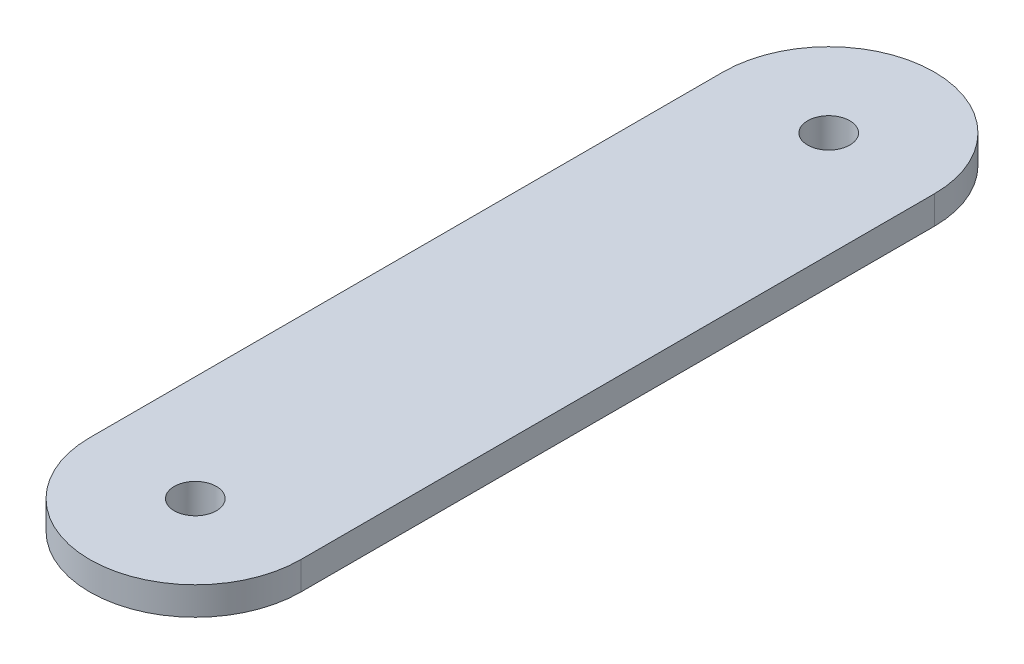
ISO-10303-21;
HEADER;
FILE_DESCRIPTION(('STEP AP214'),'2;1');
FILE_NAME('part.step','',(''),(''),'','','');
FILE_SCHEMA(('AUTOMOTIVE_DESIGN { 1 0 10303 214 1 1 1 1 }'));
ENDSEC;
DATA;
#1=APPLICATION_CONTEXT('core data for automotive mechanical design processes');
#2=APPLICATION_PROTOCOL_DEFINITION('international standard','automotive_design',2000,#1);
#3=PRODUCT_CONTEXT('',#1,'mechanical');
#4=PRODUCT('Part','Part','',(#3));
#5=PRODUCT_RELATED_PRODUCT_CATEGORY('part','',(#4));
#6=PRODUCT_DEFINITION_FORMATION('','',#4);
#7=PRODUCT_DEFINITION_CONTEXT('part definition',#1,'design');
#8=PRODUCT_DEFINITION('design','',#6,#7);
#9=PRODUCT_DEFINITION_SHAPE('','',#8);
#10=(LENGTH_UNIT() NAMED_UNIT(*) SI_UNIT(.MILLI.,.METRE.));
#11=(NAMED_UNIT(*) PLANE_ANGLE_UNIT() SI_UNIT($,.RADIAN.));
#12=(NAMED_UNIT(*) SI_UNIT($,.STERADIAN.) SOLID_ANGLE_UNIT());
#13=UNCERTAINTY_MEASURE_WITH_UNIT(LENGTH_MEASURE(1.E-05),#10,'distance_accuracy_value','');
#14=(GEOMETRIC_REPRESENTATION_CONTEXT(3) GLOBAL_UNCERTAINTY_ASSIGNED_CONTEXT((#13)) GLOBAL_UNIT_ASSIGNED_CONTEXT((#10,
#11,#12)) REPRESENTATION_CONTEXT('',''));
#15=CARTESIAN_POINT('',(0.,0.,0.));
#16=DIRECTION('',(0.,0.,1.));
#17=DIRECTION('',(1.,0.,0.));
#18=AXIS2_PLACEMENT_3D('',#15,#16,#17);
#19=CARTESIAN_POINT('',(0.,0.,-22.5));
#20=DIRECTION('',(0.,1.,0.));
#21=DIRECTION('',(0.,0.,1.));
#22=AXIS2_PLACEMENT_3D('',#19,#20,#21);
#23=PLANE('',#22);
#24=CARTESIAN_POINT('',(0.,0.,-22.5));
#25=DIRECTION('',(0.,1.,0.));
#26=DIRECTION('',(0.,0.,1.));
#27=AXIS2_PLACEMENT_3D('',#24,#25,#26);
#28=CIRCLE('',#27,4.42944947177033);
#29=CARTESIAN_POINT('',(0.,0.,-18.0705505282297));
#30=VERTEX_POINT('',#29);
#31=EDGE_CURVE('E11',#30,#30,#28,.T.);
#32=ORIENTED_EDGE('',*,*,#31,.T.);
#33=EDGE_LOOP('',(#32));
#34=FACE_BOUND('',#33,.T.);
#35=CARTESIAN_POINT('',(0.,0.,22.5));
#36=DIRECTION('',(0.,1.,0.));
#37=DIRECTION('',(0.,0.,1.));
#38=AXIS2_PLACEMENT_3D('',#35,#36,#37);
#39=CIRCLE('',#38,4.42944947177033);
#40=CARTESIAN_POINT('',(0.,0.,26.9294494717703));
#41=VERTEX_POINT('',#40);
#42=EDGE_CURVE('E46',#41,#41,#39,.T.);
#43=ORIENTED_EDGE('',*,*,#42,.T.);
#44=EDGE_LOOP('',(#43));
#45=FACE_BOUND('',#44,.T.);
#46=CARTESIAN_POINT('',(0.,0.,-22.5));
#47=DIRECTION('',(0.,1.,0.));
#48=DIRECTION('',(0.,0.,1.));
#49=AXIS2_PLACEMENT_3D('',#46,#47,#48);
#50=CIRCLE('',#49,7.5);
#51=CARTESIAN_POINT('',(7.49999999999999,0.,-22.5));
#52=VERTEX_POINT('',#51);
#53=CARTESIAN_POINT('',(-7.50000000000001,0.,-22.5));
#54=VERTEX_POINT('',#53);
#55=EDGE_CURVE('E105',#52,#54,#50,.T.);
#56=ORIENTED_EDGE('',*,*,#55,.F.);
#57=DIRECTION('',(0.,0.,-1.));
#58=VECTOR('',#57,1.);
#59=CARTESIAN_POINT('',(7.49999999999999,0.,-22.5));
#60=LINE('',#59,#58);
#61=CARTESIAN_POINT('',(7.5,0.,22.5));
#62=VERTEX_POINT('',#61);
#63=EDGE_CURVE('E77',#62,#52,#60,.T.);
#64=ORIENTED_EDGE('',*,*,#63,.F.);
#65=CARTESIAN_POINT('',(0.,0.,22.5));
#66=DIRECTION('',(0.,1.,0.));
#67=DIRECTION('',(0.,0.,1.));
#68=AXIS2_PLACEMENT_3D('',#65,#66,#67);
#69=CIRCLE('',#68,7.5);
#70=CARTESIAN_POINT('',(-7.5,0.,22.5));
#71=VERTEX_POINT('',#70);
#72=EDGE_CURVE('E71',#71,#62,#69,.T.);
#73=ORIENTED_EDGE('',*,*,#72,.F.);
#74=DIRECTION('',(0.,0.,1.));
#75=VECTOR('',#74,1.);
#76=CARTESIAN_POINT('',(-7.50000000000001,0.,-22.5));
#77=LINE('',#76,#75);
#78=EDGE_CURVE('E95',#54,#71,#77,.T.);
#79=ORIENTED_EDGE('',*,*,#78,.F.);
#80=EDGE_LOOP('',(#56,#64,#73,#79));
#81=FACE_BOUND('',#80,.T.);
#82=ADVANCED_FACE('F37',(#34,#45,#81),#23,.F.);
#83=CARTESIAN_POINT('',(0.,2.,-22.5));
#84=DIRECTION('',(0.,-1.,0.));
#85=DIRECTION('',(0.,0.,-1.));
#86=AXIS2_PLACEMENT_3D('',#83,#84,#85);
#87=CYLINDRICAL_SURFACE('',#86,7.5);
#88=ORIENTED_EDGE('',*,*,#55,.T.);
#89=DIRECTION('',(0.,-1.,0.));
#90=VECTOR('',#89,1.);
#91=CARTESIAN_POINT('',(-7.50000000000001,2.,-22.5));
#92=LINE('',#91,#90);
#93=CARTESIAN_POINT('',(-7.50000000000001,2.,-22.5));
#94=VERTEX_POINT('',#93);
#95=EDGE_CURVE('E96',#94,#54,#92,.T.);
#96=ORIENTED_EDGE('',*,*,#95,.F.);
#97=CARTESIAN_POINT('',(0.,2.,-22.5));
#98=DIRECTION('',(0.,1.,0.));
#99=DIRECTION('',(0.,0.,1.));
#100=AXIS2_PLACEMENT_3D('',#97,#98,#99);
#101=CIRCLE('',#100,7.5);
#102=CARTESIAN_POINT('',(7.49999999999999,2.,-22.5));
#103=VERTEX_POINT('',#102);
#104=EDGE_CURVE('E90',#103,#94,#101,.T.);
#105=ORIENTED_EDGE('',*,*,#104,.F.);
#106=DIRECTION('',(0.,-1.,0.));
#107=VECTOR('',#106,1.);
#108=CARTESIAN_POINT('',(7.49999999999999,2.,-22.5));
#109=LINE('',#108,#107);
#110=EDGE_CURVE('E101',#103,#52,#109,.T.);
#111=ORIENTED_EDGE('',*,*,#110,.T.);
#112=EDGE_LOOP('',(#88,#96,#105,#111));
#113=FACE_BOUND('',#112,.T.);
#114=ADVANCED_FACE('F166',(#113),#87,.T.);
#115=CARTESIAN_POINT('',(-7.50000000000001,2.,-22.5));
#116=DIRECTION('',(1.,0.,0.));
#117=DIRECTION('',(0.,0.,-1.));
#118=AXIS2_PLACEMENT_3D('',#115,#116,#117);
#119=PLANE('',#118);
#120=ORIENTED_EDGE('',*,*,#78,.T.);
#121=DIRECTION('',(0.,-1.,0.));
#122=VECTOR('',#121,1.);
#123=CARTESIAN_POINT('',(-7.5,2.,22.5));
#124=LINE('',#123,#122);
#125=CARTESIAN_POINT('',(-7.5,2.,22.5));
#126=VERTEX_POINT('',#125);
#127=EDGE_CURVE('E93',#126,#71,#124,.T.);
#128=ORIENTED_EDGE('',*,*,#127,.F.);
#129=DIRECTION('',(0.,0.,1.));
#130=VECTOR('',#129,1.);
#131=CARTESIAN_POINT('',(-7.50000000000001,2.,-22.5));
#132=LINE('',#131,#130);
#133=EDGE_CURVE('E85',#94,#126,#132,.T.);
#134=ORIENTED_EDGE('',*,*,#133,.F.);
#135=ORIENTED_EDGE('',*,*,#95,.T.);
#136=EDGE_LOOP('',(#120,#128,#134,#135));
#137=FACE_BOUND('',#136,.T.);
#138=ADVANCED_FACE('F94',(#137),#119,.F.);
#139=CARTESIAN_POINT('',(0.,2.,22.5));
#140=DIRECTION('',(0.,-1.,0.));
#141=DIRECTION('',(0.,0.,-1.));
#142=AXIS2_PLACEMENT_3D('',#139,#140,#141);
#143=CYLINDRICAL_SURFACE('',#142,7.5);
#144=ORIENTED_EDGE('',*,*,#72,.T.);
#145=DIRECTION('',(0.,-1.,0.));
#146=VECTOR('',#145,1.);
#147=CARTESIAN_POINT('',(7.5,2.,22.5));
#148=LINE('',#147,#146);
#149=CARTESIAN_POINT('',(7.5,2.,22.5));
#150=VERTEX_POINT('',#149);
#151=EDGE_CURVE('E97',#150,#62,#148,.T.);
#152=ORIENTED_EDGE('',*,*,#151,.F.);
#153=CARTESIAN_POINT('',(0.,2.,22.5));
#154=DIRECTION('',(0.,1.,0.));
#155=DIRECTION('',(0.,0.,1.));
#156=AXIS2_PLACEMENT_3D('',#153,#154,#155);
#157=CIRCLE('',#156,7.5);
#158=EDGE_CURVE('E88',#126,#150,#157,.T.);
#159=ORIENTED_EDGE('',*,*,#158,.F.);
#160=ORIENTED_EDGE('',*,*,#127,.T.);
#161=EDGE_LOOP('',(#144,#152,#159,#160));
#162=FACE_BOUND('',#161,.T.);
#163=ADVANCED_FACE('F99',(#162),#143,.T.);
#164=CARTESIAN_POINT('',(7.49999999999999,2.,-22.5));
#165=DIRECTION('',(-1.,0.,0.));
#166=DIRECTION('',(0.,0.,1.));
#167=AXIS2_PLACEMENT_3D('',#164,#165,#166);
#168=PLANE('',#167);
#169=ORIENTED_EDGE('',*,*,#63,.T.);
#170=ORIENTED_EDGE('',*,*,#110,.F.);
#171=DIRECTION('',(0.,0.,-1.));
#172=VECTOR('',#171,1.);
#173=CARTESIAN_POINT('',(7.49999999999999,2.,-22.5));
#174=LINE('',#173,#172);
#175=EDGE_CURVE('E54',#150,#103,#174,.T.);
#176=ORIENTED_EDGE('',*,*,#175,.F.);
#177=ORIENTED_EDGE('',*,*,#151,.T.);
#178=EDGE_LOOP('',(#169,#170,#176,#177));
#179=FACE_BOUND('',#178,.T.);
#180=ADVANCED_FACE('F145',(#179),#168,.F.);
#181=CARTESIAN_POINT('',(0.,2.,-22.5));
#182=DIRECTION('',(0.,1.,0.));
#183=DIRECTION('',(0.,0.,1.));
#184=AXIS2_PLACEMENT_3D('',#181,#182,#183);
#185=PLANE('',#184);
#186=CARTESIAN_POINT('',(0.,2.,-22.5));
#187=DIRECTION('',(0.,1.,0.));
#188=DIRECTION('',(0.,0.,1.));
#189=AXIS2_PLACEMENT_3D('',#186,#187,#188);
#190=CIRCLE('',#189,1.5);
#191=CARTESIAN_POINT('',(0.,2.,-21.));
#192=VERTEX_POINT('',#191);
#193=EDGE_CURVE('E108',#192,#192,#190,.T.);
#194=ORIENTED_EDGE('',*,*,#193,.F.);
#195=EDGE_LOOP('',(#194));
#196=FACE_BOUND('',#195,.T.);
#197=CARTESIAN_POINT('',(0.,2.,22.5));
#198=DIRECTION('',(0.,1.,0.));
#199=DIRECTION('',(0.,0.,1.));
#200=AXIS2_PLACEMENT_3D('',#197,#198,#199);
#201=CIRCLE('',#200,1.5);
#202=CARTESIAN_POINT('',(0.,2.,24.));
#203=VERTEX_POINT('',#202);
#204=EDGE_CURVE('E126',#203,#203,#201,.T.);
#205=ORIENTED_EDGE('',*,*,#204,.F.);
#206=EDGE_LOOP('',(#205));
#207=FACE_BOUND('',#206,.T.);
#208=ORIENTED_EDGE('',*,*,#104,.T.);
#209=ORIENTED_EDGE('',*,*,#133,.T.);
#210=ORIENTED_EDGE('',*,*,#158,.T.);
#211=ORIENTED_EDGE('',*,*,#175,.T.);
#212=EDGE_LOOP('',(#208,#209,#210,#211));
#213=FACE_BOUND('',#212,.T.);
#214=ADVANCED_FACE('F86',(#196,#207,#213),#185,.T.);
#215=CARTESIAN_POINT('',(0.,0.,22.5));
#216=DIRECTION('',(0.,1.,0.));
#217=DIRECTION('',(0.,0.,1.));
#218=AXIS2_PLACEMENT_3D('',#215,#216,#217);
#219=CYLINDRICAL_SURFACE('',#218,1.5);
#220=ORIENTED_EDGE('',*,*,#204,.T.);
#221=EDGE_LOOP('',(#220));
#222=FACE_BOUND('',#221,.T.);
#223=CARTESIAN_POINT('',(0.,-0.5,22.5));
#224=DIRECTION('',(0.,-1.,0.));
#225=DIRECTION('',(0.,0.,-1.));
#226=AXIS2_PLACEMENT_3D('',#223,#224,#225);
#227=CIRCLE('',#226,1.5);
#228=CARTESIAN_POINT('',(0.,-0.5,21.));
#229=VERTEX_POINT('',#228);
#230=EDGE_CURVE('E127',#229,#229,#227,.T.);
#231=ORIENTED_EDGE('',*,*,#230,.T.);
#232=EDGE_LOOP('',(#231));
#233=FACE_BOUND('',#232,.T.);
#234=ADVANCED_FACE('F144',(#222,#233),#219,.F.);
#235=CARTESIAN_POINT('',(0.,0.,-22.5));
#236=DIRECTION('',(0.,1.,0.));
#237=DIRECTION('',(0.,0.,1.));
#238=AXIS2_PLACEMENT_3D('',#235,#236,#237);
#239=CYLINDRICAL_SURFACE('',#238,1.5);
#240=ORIENTED_EDGE('',*,*,#193,.T.);
#241=EDGE_LOOP('',(#240));
#242=FACE_BOUND('',#241,.T.);
#243=CARTESIAN_POINT('',(0.,-0.5,-22.5));
#244=DIRECTION('',(0.,-1.,0.));
#245=DIRECTION('',(0.,0.,1.));
#246=AXIS2_PLACEMENT_3D('',#243,#244,#245);
#247=CIRCLE('',#246,1.5);
#248=CARTESIAN_POINT('',(0.,-0.5,-21.));
#249=VERTEX_POINT('',#248);
#250=EDGE_CURVE('E188',#249,#249,#247,.T.);
#251=ORIENTED_EDGE('',*,*,#250,.T.);
#252=EDGE_LOOP('',(#251));
#253=FACE_BOUND('',#252,.T.);
#254=ADVANCED_FACE('F139',(#242,#253),#239,.F.);
#255=CARTESIAN_POINT('',(0.,-0.5,22.5));
#256=DIRECTION('',(0.,-1.,0.));
#257=DIRECTION('',(0.,0.,-1.));
#258=AXIS2_PLACEMENT_3D('',#255,#256,#257);
#259=PLANE('',#258);
#260=CARTESIAN_POINT('',(0.,-0.5,22.5));
#261=DIRECTION('',(0.,-1.,0.));
#262=DIRECTION('',(0.,0.,-1.));
#263=AXIS2_PLACEMENT_3D('',#260,#261,#262);
#264=CIRCLE('',#263,2.25);
#265=CARTESIAN_POINT('',(0.,-0.5,20.25));
#266=VERTEX_POINT('',#265);
#267=EDGE_CURVE('E124',#266,#266,#264,.T.);
#268=ORIENTED_EDGE('',*,*,#267,.T.);
#269=EDGE_LOOP('',(#268));
#270=FACE_BOUND('',#269,.T.);
#271=ORIENTED_EDGE('',*,*,#230,.F.);
#272=EDGE_LOOP('',(#271));
#273=FACE_BOUND('',#272,.T.);
#274=ADVANCED_FACE('F154',(#270,#273),#259,.T.);
#275=CARTESIAN_POINT('',(0.,-0.5,-22.5));
#276=DIRECTION('',(0.,1.,0.));
#277=DIRECTION('',(0.,0.,1.));
#278=AXIS2_PLACEMENT_3D('',#275,#276,#277);
#279=PLANE('',#278);
#280=CARTESIAN_POINT('',(0.,-0.5,-22.5));
#281=DIRECTION('',(0.,-1.,0.));
#282=DIRECTION('',(0.,0.,1.));
#283=AXIS2_PLACEMENT_3D('',#280,#281,#282);
#284=CIRCLE('',#283,2.25);
#285=CARTESIAN_POINT('',(0.,-0.5,-20.25));
#286=VERTEX_POINT('',#285);
#287=EDGE_CURVE('E132',#286,#286,#284,.T.);
#288=ORIENTED_EDGE('',*,*,#287,.T.);
#289=EDGE_LOOP('',(#288));
#290=FACE_BOUND('',#289,.T.);
#291=ORIENTED_EDGE('',*,*,#250,.F.);
#292=EDGE_LOOP('',(#291));
#293=FACE_BOUND('',#292,.T.);
#294=ADVANCED_FACE('F156',(#290,#293),#279,.F.);
#295=CARTESIAN_POINT('',(0.,-5.,-22.5));
#296=DIRECTION('',(0.,1.,0.));
#297=DIRECTION('',(0.,0.,1.));
#298=AXIS2_PLACEMENT_3D('',#295,#296,#297);
#299=DEGENERATE_TOROIDAL_SURFACE('',#298,4.42944947177033,5.,.T.);
#300=ORIENTED_EDGE('',*,*,#31,.F.);
#301=EDGE_LOOP('',(#300));
#302=FACE_BOUND('',#301,.T.);
#303=ORIENTED_EDGE('',*,*,#287,.F.);
#304=EDGE_LOOP('',(#303));
#305=FACE_BOUND('',#304,.T.);
#306=ADVANCED_FACE('F121',(#302,#305),#299,.F.);
#307=CARTESIAN_POINT('',(0.,-5.,22.5));
#308=DIRECTION('',(0.,1.,0.));
#309=DIRECTION('',(0.,0.,1.));
#310=AXIS2_PLACEMENT_3D('',#307,#308,#309);
#311=DEGENERATE_TOROIDAL_SURFACE('',#310,4.42944947177033,5.,.T.);
#312=ORIENTED_EDGE('',*,*,#42,.F.);
#313=EDGE_LOOP('',(#312));
#314=FACE_BOUND('',#313,.T.);
#315=ORIENTED_EDGE('',*,*,#267,.F.);
#316=EDGE_LOOP('',(#315));
#317=FACE_BOUND('',#316,.T.);
#318=ADVANCED_FACE('F39',(#314,#317),#311,.F.);
#319=CLOSED_SHELL('',(#82,#114,#138,#163,#180,#214,#234,#254,#274,#294,#306,#318));
#320=MANIFOLD_SOLID_BREP('B2',#319);
#321=ADVANCED_BREP_SHAPE_REPRESENTATION('',(#18,#320),#14);
#322=SHAPE_DEFINITION_REPRESENTATION(#9,#321);
ENDSEC;
END-ISO-10303-21;
